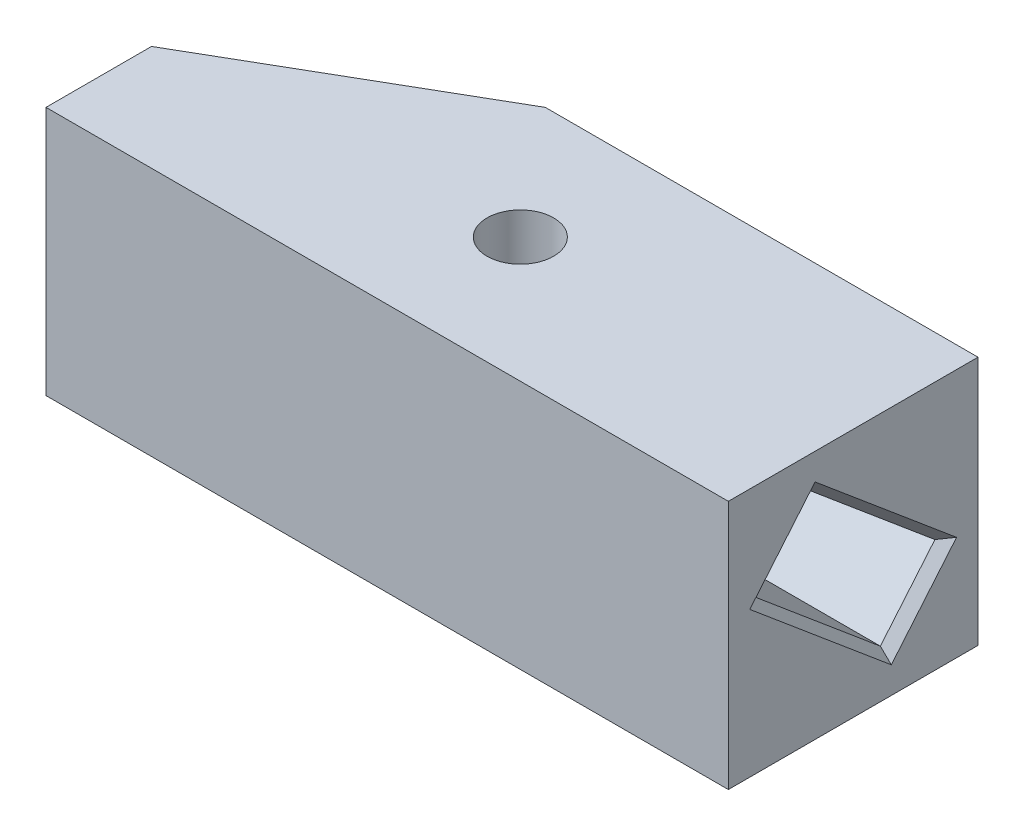
ISO-10303-21;
HEADER;
FILE_DESCRIPTION(('STEP AP214'),'2;1');
FILE_NAME('part.step','',(''),(''),'','','');
FILE_SCHEMA(('AUTOMOTIVE_DESIGN { 1 0 10303 214 1 1 1 1 }'));
ENDSEC;
DATA;
#1=APPLICATION_CONTEXT('core data for automotive mechanical design processes');
#2=APPLICATION_PROTOCOL_DEFINITION('international standard','automotive_design',2000,#1);
#3=PRODUCT_CONTEXT('',#1,'mechanical');
#4=PRODUCT('Part','Part','',(#3));
#5=PRODUCT_RELATED_PRODUCT_CATEGORY('part','',(#4));
#6=PRODUCT_DEFINITION_FORMATION('','',#4);
#7=PRODUCT_DEFINITION_CONTEXT('part definition',#1,'design');
#8=PRODUCT_DEFINITION('design','',#6,#7);
#9=PRODUCT_DEFINITION_SHAPE('','',#8);
#10=(LENGTH_UNIT() NAMED_UNIT(*) SI_UNIT(.MILLI.,.METRE.));
#11=(NAMED_UNIT(*) PLANE_ANGLE_UNIT() SI_UNIT($,.RADIAN.));
#12=(NAMED_UNIT(*) SI_UNIT($,.STERADIAN.) SOLID_ANGLE_UNIT());
#13=UNCERTAINTY_MEASURE_WITH_UNIT(LENGTH_MEASURE(1.E-05),#10,'distance_accuracy_value','');
#14=(GEOMETRIC_REPRESENTATION_CONTEXT(3) GLOBAL_UNCERTAINTY_ASSIGNED_CONTEXT((#13)) GLOBAL_UNIT_ASSIGNED_CONTEXT((#10,
#11,#12)) REPRESENTATION_CONTEXT('',''));
#15=CARTESIAN_POINT('',(0.,0.,0.));
#16=DIRECTION('',(0.,0.,1.));
#17=DIRECTION('',(1.,0.,0.));
#18=AXIS2_PLACEMENT_3D('',#15,#16,#17);
#19=CARTESIAN_POINT('',(20.,30.,15.));
#20=DIRECTION('',(-1.,0.,0.));
#21=DIRECTION('',(0.,0.,1.));
#22=AXIS2_PLACEMENT_3D('',#19,#20,#21);
#23=PLANE('',#22);
#24=DIRECTION('',(0.,-0.642787609686535,-0.766044443118982));
#25=VECTOR('',#24,1.);
#26=CARTESIAN_POINT('',(20.,33.2565679181153,12.2674150610057));
#27=LINE('',#26,#25);
#28=CARTESIAN_POINT('',(20.,26.8078135705464,4.58208889953284));
#29=VERTEX_POINT('',#28);
#30=CARTESIAN_POINT('',(20.,12.5379286355053,-12.4240977377086));
#31=VERTEX_POINT('',#30);
#32=EDGE_CURVE('E206',#29,#31,#27,.T.);
#33=ORIENTED_EDGE('',*,*,#32,.T.);
#34=DIRECTION('',(0.,-0.766044443118982,0.642787609686535));
#35=VECTOR('',#34,1.);
#36=CARTESIAN_POINT('',(20.,9.28136071738995,-9.69151279871434));
#37=LINE('',#36,#35);
#38=CARTESIAN_POINT('',(20.,3.19218642945362,-4.58208889953284));
#39=VERTEX_POINT('',#38);
#40=EDGE_CURVE('E208',#31,#39,#37,.T.);
#41=ORIENTED_EDGE('',*,*,#40,.T.);
#42=DIRECTION('',(0.,0.642787609686535,0.766044443118982));
#43=VECTOR('',#42,1.);
#44=CARTESIAN_POINT('',(20.,23.9108257120637,20.1094238991815));
#45=LINE('',#44,#43);
#46=CARTESIAN_POINT('',(20.,17.4620713644947,12.4240977377086));
#47=VERTEX_POINT('',#46);
#48=EDGE_CURVE('E202',#39,#47,#45,.T.);
#49=ORIENTED_EDGE('',*,*,#48,.T.);
#50=DIRECTION('',(0.,0.766044443118982,-0.642787609686535));
#51=VECTOR('',#50,1.);
#52=CARTESIAN_POINT('',(20.,23.5512456524311,7.31467383852711));
#53=LINE('',#52,#51);
#54=EDGE_CURVE('E204',#47,#29,#53,.T.);
#55=ORIENTED_EDGE('',*,*,#54,.T.);
#56=EDGE_LOOP('',(#33,#41,#49,#55));
#57=FACE_BOUND('',#56,.T.);
#58=DIRECTION('',(0.,0.,-1.));
#59=VECTOR('',#58,1.);
#60=CARTESIAN_POINT('',(20.,0.,15.));
#61=LINE('',#60,#59);
#62=CARTESIAN_POINT('',(20.,0.,15.));
#63=VERTEX_POINT('',#62);
#64=CARTESIAN_POINT('',(20.,0.,-15.));
#65=VERTEX_POINT('',#64);
#66=EDGE_CURVE('E175',#63,#65,#61,.T.);
#67=ORIENTED_EDGE('',*,*,#66,.T.);
#68=DIRECTION('',(0.,-1.,0.));
#69=VECTOR('',#68,1.);
#70=CARTESIAN_POINT('',(20.,30.,-15.));
#71=LINE('',#70,#69);
#72=CARTESIAN_POINT('',(20.,30.,-15.));
#73=VERTEX_POINT('',#72);
#74=EDGE_CURVE('E189',#73,#65,#71,.T.);
#75=ORIENTED_EDGE('',*,*,#74,.F.);
#76=DIRECTION('',(0.,0.,-1.));
#77=VECTOR('',#76,1.);
#78=CARTESIAN_POINT('',(20.,30.,15.));
#79=LINE('',#78,#77);
#80=CARTESIAN_POINT('',(20.,30.,15.));
#81=VERTEX_POINT('',#80);
#82=EDGE_CURVE('E178',#81,#73,#79,.T.);
#83=ORIENTED_EDGE('',*,*,#82,.F.);
#84=DIRECTION('',(0.,-1.,0.));
#85=VECTOR('',#84,1.);
#86=CARTESIAN_POINT('',(20.,30.,15.));
#87=LINE('',#86,#85);
#88=EDGE_CURVE('E125',#81,#63,#87,.T.);
#89=ORIENTED_EDGE('',*,*,#88,.T.);
#90=EDGE_LOOP('',(#67,#75,#83,#89));
#91=FACE_BOUND('',#90,.T.);
#92=ADVANCED_FACE('F35',(#57,#91),#23,.F.);
#93=CARTESIAN_POINT('',(-35.,30.,-15.));
#94=DIRECTION('',(0.,0.,1.));
#95=DIRECTION('',(1.,0.,0.));
#96=AXIS2_PLACEMENT_3D('',#93,#94,#95);
#97=PLANE('',#96);
#98=DIRECTION('',(-1.,0.,0.));
#99=VECTOR('',#98,1.);
#100=CARTESIAN_POINT('',(-35.,0.,-15.));
#101=LINE('',#100,#99);
#102=CARTESIAN_POINT('',(-31.9999999999998,0.,-15.));
#103=VERTEX_POINT('',#102);
#104=EDGE_CURVE('E184',#65,#103,#101,.T.);
#105=ORIENTED_EDGE('',*,*,#104,.T.);
#106=DIRECTION('',(0.,1.,0.));
#107=VECTOR('',#106,1.);
#108=CARTESIAN_POINT('',(-31.9999999999998,30.,-15.));
#109=LINE('',#108,#107);
#110=CARTESIAN_POINT('',(-31.9999999999998,30.,-15.));
#111=VERTEX_POINT('',#110);
#112=EDGE_CURVE('E196',#103,#111,#109,.T.);
#113=ORIENTED_EDGE('',*,*,#112,.T.);
#114=DIRECTION('',(-1.,0.,0.));
#115=VECTOR('',#114,1.);
#116=CARTESIAN_POINT('',(-20.,30.,-15.));
#117=LINE('',#116,#115);
#118=EDGE_CURVE('E129',#73,#111,#117,.T.);
#119=ORIENTED_EDGE('',*,*,#118,.F.);
#120=ORIENTED_EDGE('',*,*,#74,.T.);
#121=EDGE_LOOP('',(#105,#113,#119,#120));
#122=FACE_BOUND('',#121,.T.);
#123=ADVANCED_FACE('F256',(#122),#97,.F.);
#124=CARTESIAN_POINT('',(-20.,30.,15.));
#125=DIRECTION('',(0.,0.,-1.));
#126=DIRECTION('',(-1.,0.,0.));
#127=AXIS2_PLACEMENT_3D('',#124,#125,#126);
#128=PLANE('',#127);
#129=DIRECTION('',(1.,0.,0.));
#130=VECTOR('',#129,1.);
#131=CARTESIAN_POINT('',(-20.,0.,15.));
#132=LINE('',#131,#130);
#133=CARTESIAN_POINT('',(-62.,0.,15.));
#134=VERTEX_POINT('',#133);
#135=EDGE_CURVE('E180',#134,#63,#132,.T.);
#136=ORIENTED_EDGE('',*,*,#135,.T.);
#137=ORIENTED_EDGE('',*,*,#88,.F.);
#138=DIRECTION('',(1.,0.,0.));
#139=VECTOR('',#138,1.);
#140=CARTESIAN_POINT('',(-20.,30.,15.));
#141=LINE('',#140,#139);
#142=CARTESIAN_POINT('',(-62.,30.,15.));
#143=VERTEX_POINT('',#142);
#144=EDGE_CURVE('E119',#143,#81,#141,.T.);
#145=ORIENTED_EDGE('',*,*,#144,.F.);
#146=DIRECTION('',(0.,1.,0.));
#147=VECTOR('',#146,1.);
#148=CARTESIAN_POINT('',(-62.,0.,15.));
#149=LINE('',#148,#147);
#150=EDGE_CURVE('E123',#134,#143,#149,.T.);
#151=ORIENTED_EDGE('',*,*,#150,.F.);
#152=EDGE_LOOP('',(#136,#137,#145,#151));
#153=FACE_BOUND('',#152,.T.);
#154=ADVANCED_FACE('F121',(#153),#128,.F.);
#155=CARTESIAN_POINT('',(0.,30.,0.));
#156=DIRECTION('',(0.,-1.,0.));
#157=DIRECTION('',(0.,0.,-1.));
#158=AXIS2_PLACEMENT_3D('',#155,#156,#157);
#159=PLANE('',#158);
#160=CARTESIAN_POINT('',(-20.,30.,0.));
#161=DIRECTION('',(0.,1.,0.));
#162=DIRECTION('',(0.,0.,1.));
#163=AXIS2_PLACEMENT_3D('',#160,#161,#162);
#164=CIRCLE('',#163,4.);
#165=CARTESIAN_POINT('',(-20.,30.,4.));
#166=VERTEX_POINT('',#165);
#167=EDGE_CURVE('E165',#166,#166,#164,.T.);
#168=ORIENTED_EDGE('',*,*,#167,.F.);
#169=EDGE_LOOP('',(#168));
#170=FACE_BOUND('',#169,.T.);
#171=ORIENTED_EDGE('',*,*,#118,.T.);
#172=DIRECTION('',(0.86602540378444,0.,-0.499999999999998));
#173=VECTOR('',#172,1.);
#174=CARTESIAN_POINT('',(-62.,30.,2.3205080756888));
#175=LINE('',#174,#173);
#176=CARTESIAN_POINT('',(-62.,30.,2.32050807568879));
#177=VERTEX_POINT('',#176);
#178=EDGE_CURVE('E136',#111,#177,#175,.F.);
#179=ORIENTED_EDGE('',*,*,#178,.T.);
#180=DIRECTION('',(0.,0.,-1.));
#181=VECTOR('',#180,1.);
#182=CARTESIAN_POINT('',(-62.,30.,-15.));
#183=LINE('',#182,#181);
#184=EDGE_CURVE('E132',#143,#177,#183,.T.);
#185=ORIENTED_EDGE('',*,*,#184,.F.);
#186=ORIENTED_EDGE('',*,*,#144,.T.);
#187=ORIENTED_EDGE('',*,*,#82,.T.);
#188=EDGE_LOOP('',(#171,#179,#185,#186,#187));
#189=FACE_BOUND('',#188,.T.);
#190=ADVANCED_FACE('F134',(#170,#189),#159,.F.);
#191=CARTESIAN_POINT('',(0.,0.,0.));
#192=DIRECTION('',(0.,-1.,0.));
#193=DIRECTION('',(0.,0.,-1.));
#194=AXIS2_PLACEMENT_3D('',#191,#192,#193);
#195=PLANE('',#194);
#196=CARTESIAN_POINT('',(-20.,0.,0.));
#197=DIRECTION('',(0.,1.,0.));
#198=DIRECTION('',(0.,0.,1.));
#199=AXIS2_PLACEMENT_3D('',#196,#197,#198);
#200=CIRCLE('',#199,4.);
#201=CARTESIAN_POINT('',(-20.,0.,4.));
#202=VERTEX_POINT('',#201);
#203=EDGE_CURVE('E172',#202,#202,#200,.T.);
#204=ORIENTED_EDGE('',*,*,#203,.T.);
#205=EDGE_LOOP('',(#204));
#206=FACE_BOUND('',#205,.T.);
#207=DIRECTION('',(0.,0.,1.));
#208=VECTOR('',#207,1.);
#209=CARTESIAN_POINT('',(-62.,0.,-15.));
#210=LINE('',#209,#208);
#211=CARTESIAN_POINT('',(-62.,0.,2.32050807568879));
#212=VERTEX_POINT('',#211);
#213=EDGE_CURVE('E140',#212,#134,#210,.T.);
#214=ORIENTED_EDGE('',*,*,#213,.F.);
#215=DIRECTION('',(-0.86602540378444,0.,0.499999999999998));
#216=VECTOR('',#215,1.);
#217=CARTESIAN_POINT('',(-14.4951905283832,0.,-25.1064064605509));
#218=LINE('',#217,#216);
#219=EDGE_CURVE('E194',#212,#103,#218,.F.);
#220=ORIENTED_EDGE('',*,*,#219,.T.);
#221=ORIENTED_EDGE('',*,*,#104,.F.);
#222=ORIENTED_EDGE('',*,*,#66,.F.);
#223=ORIENTED_EDGE('',*,*,#135,.F.);
#224=EDGE_LOOP('',(#214,#220,#221,#222,#223));
#225=FACE_BOUND('',#224,.T.);
#226=ADVANCED_FACE('F251',(#206,#225),#195,.T.);
#227=CARTESIAN_POINT('',(-20.,0.,0.));
#228=DIRECTION('',(0.,1.,0.));
#229=DIRECTION('',(0.,0.,1.));
#230=AXIS2_PLACEMENT_3D('',#227,#228,#229);
#231=CYLINDRICAL_SURFACE('',#230,4.);
#232=ORIENTED_EDGE('',*,*,#203,.F.);
#233=EDGE_LOOP('',(#232));
#234=FACE_BOUND('',#233,.T.);
#235=ORIENTED_EDGE('',*,*,#167,.T.);
#236=EDGE_LOOP('',(#235));
#237=FACE_BOUND('',#236,.T.);
#238=ADVANCED_FACE('F244',(#234,#237),#231,.F.);
#239=CARTESIAN_POINT('',(-10.,12.4146718020728,-11.015265684903));
#240=DIRECTION('',(0.,0.766044443118982,-0.642787609686535));
#241=DIRECTION('',(0.,0.642787609686535,0.766044443118982));
#242=AXIS2_PLACEMENT_3D('',#239,#240,#241);
#243=PLANE('',#242);
#244=DIRECTION('',(1.,0.,0.));
#245=VECTOR('',#244,1.);
#246=CARTESIAN_POINT('',(-10.,12.4146718020728,-11.015265684903));
#247=LINE('',#246,#245);
#248=CARTESIAN_POINT('',(-10.,12.4146718020728,-11.015265684903));
#249=VERTEX_POINT('',#248);
#250=CARTESIAN_POINT('',(18.8082464074058,12.4146718020728,-11.015265684903));
#251=VERTEX_POINT('',#250);
#252=EDGE_CURVE('E163',#249,#251,#247,.T.);
#253=ORIENTED_EDGE('',*,*,#252,.T.);
#254=DIRECTION('',(0.,0.642787609686535,0.766044443118982));
#255=VECTOR('',#254,1.);
#256=CARTESIAN_POINT('',(18.8082464074058,12.4146718020728,-11.015265684903));
#257=LINE('',#256,#255);
#258=CARTESIAN_POINT('',(18.8082464074058,25.3989815177408,4.45883206610039));
#259=VERTEX_POINT('',#258);
#260=EDGE_CURVE('E59',#251,#259,#257,.T.);
#261=ORIENTED_EDGE('',*,*,#260,.T.);
#262=DIRECTION('',(1.,0.,0.));
#263=VECTOR('',#262,1.);
#264=CARTESIAN_POINT('',(-10.,25.3989815177408,4.45883206610039));
#265=LINE('',#264,#263);
#266=CARTESIAN_POINT('',(-10.,25.3989815177408,4.45883206610039));
#267=VERTEX_POINT('',#266);
#268=EDGE_CURVE('E162',#267,#259,#265,.T.);
#269=ORIENTED_EDGE('',*,*,#268,.F.);
#270=DIRECTION('',(0.,0.642787609686535,0.766044443118982));
#271=VECTOR('',#270,1.);
#272=CARTESIAN_POINT('',(-10.,12.4146718020728,-11.015265684903));
#273=LINE('',#272,#271);
#274=EDGE_CURVE('E150',#249,#267,#273,.T.);
#275=ORIENTED_EDGE('',*,*,#274,.F.);
#276=EDGE_LOOP('',(#253,#261,#269,#275));
#277=FACE_BOUND('',#276,.T.);
#278=ADVANCED_FACE('F242',(#277),#243,.F.);
#279=CARTESIAN_POINT('',(-10.,4.60101848225918,-4.45883206610039));
#280=DIRECTION('',(0.,-0.642787609686535,-0.766044443118982));
#281=DIRECTION('',(0.,0.766044443118982,-0.642787609686535));
#282=AXIS2_PLACEMENT_3D('',#279,#280,#281);
#283=PLANE('',#282);
#284=DIRECTION('',(1.,0.,0.));
#285=VECTOR('',#284,1.);
#286=CARTESIAN_POINT('',(-10.,4.60101848225918,-4.45883206610039));
#287=LINE('',#286,#285);
#288=CARTESIAN_POINT('',(-10.,4.60101848225918,-4.45883206610039));
#289=VERTEX_POINT('',#288);
#290=CARTESIAN_POINT('',(18.8082464074058,4.60101848225918,-4.45883206610039));
#291=VERTEX_POINT('',#290);
#292=EDGE_CURVE('E166',#289,#291,#287,.T.);
#293=ORIENTED_EDGE('',*,*,#292,.T.);
#294=DIRECTION('',(0.,0.766044443118982,-0.642787609686535));
#295=VECTOR('',#294,1.);
#296=CARTESIAN_POINT('',(18.8082464074058,4.60101848225918,-4.45883206610039));
#297=LINE('',#296,#295);
#298=EDGE_CURVE('E199',#291,#251,#297,.T.);
#299=ORIENTED_EDGE('',*,*,#298,.T.);
#300=ORIENTED_EDGE('',*,*,#252,.F.);
#301=DIRECTION('',(0.,0.766044443118982,-0.642787609686535));
#302=VECTOR('',#301,1.);
#303=CARTESIAN_POINT('',(-10.,4.60101848225918,-4.45883206610039));
#304=LINE('',#303,#302);
#305=EDGE_CURVE('E159',#289,#249,#304,.T.);
#306=ORIENTED_EDGE('',*,*,#305,.F.);
#307=EDGE_LOOP('',(#293,#299,#300,#306));
#308=FACE_BOUND('',#307,.T.);
#309=ADVANCED_FACE('F236',(#308),#283,.F.);
#310=CARTESIAN_POINT('',(-10.,4.60101848225918,-4.45883206610039));
#311=DIRECTION('',(0.,-0.766044443118982,0.642787609686535));
#312=DIRECTION('',(0.,-0.642787609686535,-0.766044443118982));
#313=AXIS2_PLACEMENT_3D('',#310,#311,#312);
#314=PLANE('',#313);
#315=DIRECTION('',(1.,0.,0.));
#316=VECTOR('',#315,1.);
#317=CARTESIAN_POINT('',(-10.,17.5853281979272,11.015265684903));
#318=LINE('',#317,#316);
#319=CARTESIAN_POINT('',(-10.,17.5853281979272,11.015265684903));
#320=VERTEX_POINT('',#319);
#321=CARTESIAN_POINT('',(18.8082464074058,17.5853281979272,11.015265684903));
#322=VERTEX_POINT('',#321);
#323=EDGE_CURVE('E169',#320,#322,#318,.T.);
#324=ORIENTED_EDGE('',*,*,#323,.T.);
#325=DIRECTION('',(0.,-0.642787609686535,-0.766044443118982));
#326=VECTOR('',#325,1.);
#327=CARTESIAN_POINT('',(18.8082464074058,4.60101848225918,-4.45883206610039));
#328=LINE('',#327,#326);
#329=EDGE_CURVE('E11',#322,#291,#328,.T.);
#330=ORIENTED_EDGE('',*,*,#329,.T.);
#331=ORIENTED_EDGE('',*,*,#292,.F.);
#332=DIRECTION('',(0.,-0.642787609686535,-0.766044443118982));
#333=VECTOR('',#332,1.);
#334=CARTESIAN_POINT('',(-10.,4.60101848225918,-4.45883206610039));
#335=LINE('',#334,#333);
#336=EDGE_CURVE('E156',#320,#289,#335,.T.);
#337=ORIENTED_EDGE('',*,*,#336,.F.);
#338=EDGE_LOOP('',(#324,#330,#331,#337));
#339=FACE_BOUND('',#338,.T.);
#340=ADVANCED_FACE('F232',(#339),#314,.F.);
#341=CARTESIAN_POINT('',(-10.,17.5853281979272,11.015265684903));
#342=DIRECTION('',(0.,0.642787609686535,0.766044443118982));
#343=DIRECTION('',(0.,-0.766044443118982,0.642787609686535));
#344=AXIS2_PLACEMENT_3D('',#341,#342,#343);
#345=PLANE('',#344);
#346=ORIENTED_EDGE('',*,*,#268,.T.);
#347=DIRECTION('',(0.,-0.766044443118982,0.642787609686535));
#348=VECTOR('',#347,1.);
#349=CARTESIAN_POINT('',(18.8082464074058,17.5853281979272,11.015265684903));
#350=LINE('',#349,#348);
#351=EDGE_CURVE('E44',#259,#322,#350,.T.);
#352=ORIENTED_EDGE('',*,*,#351,.T.);
#353=ORIENTED_EDGE('',*,*,#323,.F.);
#354=DIRECTION('',(0.,-0.766044443118982,0.642787609686535));
#355=VECTOR('',#354,1.);
#356=CARTESIAN_POINT('',(-10.,17.5853281979272,11.015265684903));
#357=LINE('',#356,#355);
#358=EDGE_CURVE('E153',#267,#320,#357,.T.);
#359=ORIENTED_EDGE('',*,*,#358,.F.);
#360=EDGE_LOOP('',(#346,#352,#353,#359));
#361=FACE_BOUND('',#360,.T.);
#362=ADVANCED_FACE('F241',(#361),#345,.F.);
#363=CARTESIAN_POINT('',(-10.,0.,0.));
#364=DIRECTION('',(-1.,0.,0.));
#365=DIRECTION('',(0.,0.,1.));
#366=AXIS2_PLACEMENT_3D('',#363,#364,#365);
#367=PLANE('',#366);
#368=ORIENTED_EDGE('',*,*,#274,.T.);
#369=ORIENTED_EDGE('',*,*,#358,.T.);
#370=ORIENTED_EDGE('',*,*,#336,.T.);
#371=ORIENTED_EDGE('',*,*,#305,.T.);
#372=EDGE_LOOP('',(#368,#369,#370,#371));
#373=FACE_BOUND('',#372,.T.);
#374=ADVANCED_FACE('F239',(#373),#367,.F.);
#375=CARTESIAN_POINT('',(-62.,0.,0.));
#376=DIRECTION('',(1.,0.,0.));
#377=DIRECTION('',(0.,0.,-1.));
#378=AXIS2_PLACEMENT_3D('',#375,#376,#377);
#379=PLANE('',#378);
#380=ORIENTED_EDGE('',*,*,#184,.T.);
#381=DIRECTION('',(0.,-1.,0.));
#382=VECTOR('',#381,1.);
#383=CARTESIAN_POINT('',(-62.,0.,2.3205080756888));
#384=LINE('',#383,#382);
#385=EDGE_CURVE('E192',#177,#212,#384,.T.);
#386=ORIENTED_EDGE('',*,*,#385,.T.);
#387=ORIENTED_EDGE('',*,*,#213,.T.);
#388=ORIENTED_EDGE('',*,*,#150,.T.);
#389=EDGE_LOOP('',(#380,#386,#387,#388));
#390=FACE_BOUND('',#389,.T.);
#391=ADVANCED_FACE('F142',(#390),#379,.F.);
#392=CARTESIAN_POINT('',(-62.,0.,2.3205080756888));
#393=DIRECTION('',(0.499999999999998,0.,0.86602540378444));
#394=DIRECTION('',(0.,-1.,0.));
#395=AXIS2_PLACEMENT_3D('',#392,#393,#394);
#396=PLANE('',#395);
#397=ORIENTED_EDGE('',*,*,#178,.F.);
#398=ORIENTED_EDGE('',*,*,#112,.F.);
#399=ORIENTED_EDGE('',*,*,#219,.F.);
#400=ORIENTED_EDGE('',*,*,#385,.F.);
#401=EDGE_LOOP('',(#397,#398,#399,#400));
#402=FACE_BOUND('',#401,.T.);
#403=ADVANCED_FACE('F267',(#402),#396,.F.);
#404=CARTESIAN_POINT('',(18.8082464074058,17.5853281979272,11.015265684903));
#405=DIRECTION('',(-0.642787609686542,0.492403876506099,0.586824088833466));
#406=DIRECTION('',(0.,-0.766044443118982,0.642787609686535));
#407=AXIS2_PLACEMENT_3D('',#404,#405,#406);
#408=PLANE('',#407);
#409=DIRECTION('',(0.644400477571769,0.761778318343547,0.0666469669749068));
#410=VECTOR('',#409,1.);
#411=CARTESIAN_POINT('',(11.7698032618439,17.0784827443896,3.73088274855076));
#412=LINE('',#411,#410);
#413=EDGE_CURVE('E147',#29,#259,#412,.F.);
#414=ORIENTED_EDGE('',*,*,#413,.F.);
#415=ORIENTED_EDGE('',*,*,#54,.F.);
#416=DIRECTION('',(0.64440047757177,-0.0666469669749059,0.761778318343546));
#417=VECTOR('',#416,1.);
#418=CARTESIAN_POINT('',(18.8082464074058,17.5853281979272,11.015265684903));
#419=LINE('',#418,#417);
#420=EDGE_CURVE('E39',#322,#47,#419,.T.);
#421=ORIENTED_EDGE('',*,*,#420,.F.);
#422=ORIENTED_EDGE('',*,*,#351,.F.);
#423=EDGE_LOOP('',(#414,#415,#421,#422));
#424=FACE_BOUND('',#423,.T.);
#425=ADVANCED_FACE('F37',(#424),#408,.F.);
#426=CARTESIAN_POINT('',(18.8082464074058,4.60101848225918,-4.45883206610039));
#427=DIRECTION('',(-0.642787609686541,-0.586824088833467,0.4924038765061));
#428=DIRECTION('',(0.,-0.642787609686535,-0.766044443118982));
#429=AXIS2_PLACEMENT_3D('',#426,#427,#428);
#430=PLANE('',#429);
#431=ORIENTED_EDGE('',*,*,#420,.T.);
#432=ORIENTED_EDGE('',*,*,#48,.F.);
#433=DIRECTION('',(-0.64440047757177,0.761778318343546,0.0666469669749081));
#434=VECTOR('',#433,1.);
#435=CARTESIAN_POINT('',(18.8082464074058,4.60101848225918,-4.45883206610039));
#436=LINE('',#435,#434);
#437=EDGE_CURVE('E215',#291,#39,#436,.F.);
#438=ORIENTED_EDGE('',*,*,#437,.F.);
#439=ORIENTED_EDGE('',*,*,#329,.F.);
#440=EDGE_LOOP('',(#431,#432,#438,#439));
#441=FACE_BOUND('',#440,.T.);
#442=ADVANCED_FACE('F229',(#441),#430,.F.);
#443=CARTESIAN_POINT('',(18.8082464074058,12.4146718020728,-11.015265684903));
#444=DIRECTION('',(-0.642787609686543,0.586824088833466,-0.492403876506099));
#445=DIRECTION('',(0.,0.642787609686535,0.766044443118982));
#446=AXIS2_PLACEMENT_3D('',#443,#444,#445);
#447=PLANE('',#446);
#448=ORIENTED_EDGE('',*,*,#413,.T.);
#449=ORIENTED_EDGE('',*,*,#260,.F.);
#450=DIRECTION('',(0.644400477571769,0.0666469669749083,-0.761778318343547));
#451=VECTOR('',#450,1.);
#452=CARTESIAN_POINT('',(15.2541810566765,12.0470934338052,-6.81382571024057));
#453=LINE('',#452,#451);
#454=EDGE_CURVE('E213',#31,#251,#453,.F.);
#455=ORIENTED_EDGE('',*,*,#454,.F.);
#456=ORIENTED_EDGE('',*,*,#32,.F.);
#457=EDGE_LOOP('',(#448,#449,#455,#456));
#458=FACE_BOUND('',#457,.T.);
#459=ADVANCED_FACE('F220',(#458),#447,.F.);
#460=CARTESIAN_POINT('',(18.8082464074058,4.60101848225918,-4.45883206610039));
#461=DIRECTION('',(-0.642787609686542,-0.492403876506099,-0.586824088833466));
#462=DIRECTION('',(0.,0.766044443118982,-0.642787609686535));
#463=AXIS2_PLACEMENT_3D('',#460,#461,#462);
#464=PLANE('',#463);
#465=ORIENTED_EDGE('',*,*,#437,.T.);
#466=ORIENTED_EDGE('',*,*,#40,.F.);
#467=ORIENTED_EDGE('',*,*,#454,.T.);
#468=ORIENTED_EDGE('',*,*,#298,.F.);
#469=EDGE_LOOP('',(#465,#466,#467,#468));
#470=FACE_BOUND('',#469,.T.);
#471=ADVANCED_FACE('F271',(#470),#464,.F.);
#472=CLOSED_SHELL('',(#92,#123,#154,#190,#226,#238,#278,#309,#340,#362,#374,#391,#403,#425,#442,
#459,#471));
#473=MANIFOLD_SOLID_BREP('B2',#472);
#474=ADVANCED_BREP_SHAPE_REPRESENTATION('',(#18,#473),#14);
#475=SHAPE_DEFINITION_REPRESENTATION(#9,#474);
ENDSEC;
END-ISO-10303-21;
